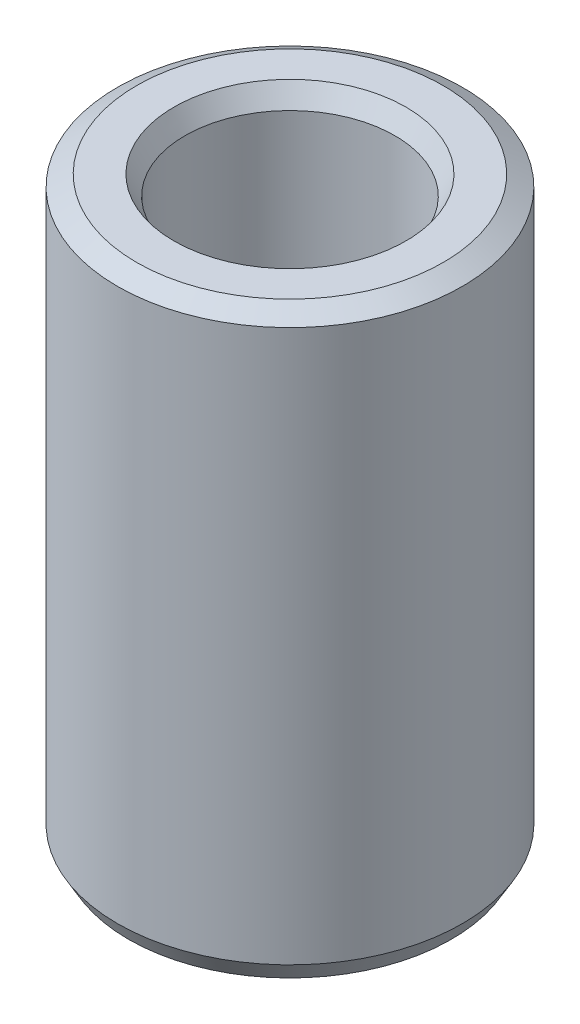
ISO-10303-21;
HEADER;
FILE_DESCRIPTION(('STEP AP214'),'2;1');
FILE_NAME('part.step','',(''),(''),'','','');
FILE_SCHEMA(('AUTOMOTIVE_DESIGN { 1 0 10303 214 1 1 1 1 }'));
ENDSEC;
DATA;
#1=APPLICATION_CONTEXT('core data for automotive mechanical design processes');
#2=APPLICATION_PROTOCOL_DEFINITION('international standard','automotive_design',2000,#1);
#3=PRODUCT_CONTEXT('',#1,'mechanical');
#4=PRODUCT('Part','Part','',(#3));
#5=PRODUCT_RELATED_PRODUCT_CATEGORY('part','',(#4));
#6=PRODUCT_DEFINITION_FORMATION('','',#4);
#7=PRODUCT_DEFINITION_CONTEXT('part definition',#1,'design');
#8=PRODUCT_DEFINITION('design','',#6,#7);
#9=PRODUCT_DEFINITION_SHAPE('','',#8);
#10=(LENGTH_UNIT() NAMED_UNIT(*) SI_UNIT(.MILLI.,.METRE.));
#11=(NAMED_UNIT(*) PLANE_ANGLE_UNIT() SI_UNIT($,.RADIAN.));
#12=(NAMED_UNIT(*) SI_UNIT($,.STERADIAN.) SOLID_ANGLE_UNIT());
#13=UNCERTAINTY_MEASURE_WITH_UNIT(LENGTH_MEASURE(1.E-05),#10,'distance_accuracy_value','');
#14=(GEOMETRIC_REPRESENTATION_CONTEXT(3) GLOBAL_UNCERTAINTY_ASSIGNED_CONTEXT((#13)) GLOBAL_UNIT_ASSIGNED_CONTEXT((#10,
#11,#12)) REPRESENTATION_CONTEXT('',''));
#15=CARTESIAN_POINT('',(0.,0.,0.));
#16=DIRECTION('',(0.,0.,1.));
#17=DIRECTION('',(1.,0.,0.));
#18=AXIS2_PLACEMENT_3D('',#15,#16,#17);
#19=CARTESIAN_POINT('',(0.,143.456491822733,0.));
#20=DIRECTION('',(0.,-1.,0.));
#21=DIRECTION('',(0.,0.,-1.));
#22=AXIS2_PLACEMENT_3D('',#19,#20,#21);
#23=CYLINDRICAL_SURFACE('',#22,42.5);
#24=CARTESIAN_POINT('',(0.,4.73199062983629,0.));
#25=DIRECTION('',(0.,1.,0.));
#26=DIRECTION('',(0.,0.,1.));
#27=AXIS2_PLACEMENT_3D('',#24,#25,#26);
#28=CIRCLE('',#27,42.5);
#29=CARTESIAN_POINT('',(0.,4.73199062983629,42.5));
#30=VERTEX_POINT('',#29);
#31=EDGE_CURVE('E10',#30,#30,#28,.T.);
#32=ORIENTED_EDGE('',*,*,#31,.T.);
#33=EDGE_LOOP('',(#32));
#34=FACE_BOUND('',#33,.T.);
#35=CARTESIAN_POINT('',(0.,140.724475758794,0.));
#36=DIRECTION('',(0.,1.,0.));
#37=DIRECTION('',(0.,0.,1.));
#38=AXIS2_PLACEMENT_3D('',#35,#36,#37);
#39=CIRCLE('',#38,42.5);
#40=CARTESIAN_POINT('',(0.,140.724475758794,42.5));
#41=VERTEX_POINT('',#40);
#42=EDGE_CURVE('E50',#41,#41,#39,.F.);
#43=ORIENTED_EDGE('',*,*,#42,.T.);
#44=EDGE_LOOP('',(#43));
#45=FACE_BOUND('',#44,.T.);
#46=ADVANCED_FACE('F39',(#34,#45),#23,.T.);
#47=CARTESIAN_POINT('',(0.,143.456491822733,0.));
#48=DIRECTION('',(0.,1.,0.));
#49=DIRECTION('',(0.,0.,1.));
#50=AXIS2_PLACEMENT_3D('',#47,#48,#49);
#51=PLANE('',#50);
#52=CARTESIAN_POINT('',(0.,143.456491822733,0.));
#53=DIRECTION('',(0.,1.,0.));
#54=DIRECTION('',(0.,0.,1.));
#55=AXIS2_PLACEMENT_3D('',#52,#53,#54);
#56=CIRCLE('',#55,28.5861831983286);
#57=CARTESIAN_POINT('',(0.,143.456491822733,28.5861831983286));
#58=VERTEX_POINT('',#57);
#59=EDGE_CURVE('E58',#58,#58,#56,.F.);
#60=ORIENTED_EDGE('',*,*,#59,.T.);
#61=EDGE_LOOP('',(#60));
#62=FACE_BOUND('',#61,.T.);
#63=CARTESIAN_POINT('',(0.,143.456491822733,0.));
#64=DIRECTION('',(0.,1.,0.));
#65=DIRECTION('',(0.,0.,1.));
#66=AXIS2_PLACEMENT_3D('',#63,#64,#65);
#67=CIRCLE('',#66,37.7680093701637);
#68=CARTESIAN_POINT('',(0.,143.456491822733,37.7680093701637));
#69=VERTEX_POINT('',#68);
#70=EDGE_CURVE('E61',#69,#69,#67,.T.);
#71=ORIENTED_EDGE('',*,*,#70,.T.);
#72=EDGE_LOOP('',(#71));
#73=FACE_BOUND('',#72,.T.);
#74=ADVANCED_FACE('F88',(#62,#73),#51,.T.);
#75=CARTESIAN_POINT('',(0.,0.,0.));
#76=DIRECTION('',(0.,1.,0.));
#77=DIRECTION('',(0.,0.,1.));
#78=AXIS2_PLACEMENT_3D('',#75,#76,#77);
#79=PLANE('',#78);
#80=CARTESIAN_POINT('',(0.,0.,0.));
#81=DIRECTION('',(0.,1.,0.));
#82=DIRECTION('',(0.,0.,1.));
#83=AXIS2_PLACEMENT_3D('',#80,#81,#82);
#84=CIRCLE('',#83,30.5861577642262);
#85=CARTESIAN_POINT('',(0.,0.,30.5861577642262));
#86=VERTEX_POINT('',#85);
#87=EDGE_CURVE('E51',#86,#86,#84,.T.);
#88=ORIENTED_EDGE('',*,*,#87,.T.);
#89=EDGE_LOOP('',(#88));
#90=FACE_BOUND('',#89,.T.);
#91=CARTESIAN_POINT('',(0.,0.,0.));
#92=DIRECTION('',(0.,1.,0.));
#93=DIRECTION('',(0.,0.,1.));
#94=AXIS2_PLACEMENT_3D('',#91,#92,#93);
#95=CIRCLE('',#94,39.7679839360612);
#96=CARTESIAN_POINT('',(0.,0.,39.7679839360612));
#97=VERTEX_POINT('',#96);
#98=EDGE_CURVE('E54',#97,#97,#95,.F.);
#99=ORIENTED_EDGE('',*,*,#98,.T.);
#100=EDGE_LOOP('',(#99));
#101=FACE_BOUND('',#100,.T.);
#102=ADVANCED_FACE('F83',(#90,#101),#79,.F.);
#103=CARTESIAN_POINT('',(0.,143.456491822733,0.));
#104=DIRECTION('',(0.,-1.,0.));
#105=DIRECTION('',(0.,0.,-1.));
#106=AXIS2_PLACEMENT_3D('',#103,#104,#105);
#107=CYLINDRICAL_SURFACE('',#106,25.8541671343898);
#108=CARTESIAN_POINT('',(0.,138.724501192897,0.));
#109=DIRECTION('',(0.,1.,0.));
#110=DIRECTION('',(0.,0.,1.));
#111=AXIS2_PLACEMENT_3D('',#108,#109,#110);
#112=CIRCLE('',#111,25.8541671343898);
#113=CARTESIAN_POINT('',(0.,138.724501192897,25.8541671343898));
#114=VERTEX_POINT('',#113);
#115=EDGE_CURVE('E67',#114,#114,#112,.T.);
#116=ORIENTED_EDGE('',*,*,#115,.T.);
#117=EDGE_LOOP('',(#116));
#118=FACE_BOUND('',#117,.T.);
#119=CARTESIAN_POINT('',(0.,2.7320160639388,0.));
#120=DIRECTION('',(0.,1.,0.));
#121=DIRECTION('',(0.,0.,1.));
#122=AXIS2_PLACEMENT_3D('',#119,#120,#121);
#123=CIRCLE('',#122,25.8541671343898);
#124=CARTESIAN_POINT('',(0.,2.7320160639388,25.8541671343898));
#125=VERTEX_POINT('',#124);
#126=EDGE_CURVE('E69',#125,#125,#123,.F.);
#127=ORIENTED_EDGE('',*,*,#126,.T.);
#128=EDGE_LOOP('',(#127));
#129=FACE_BOUND('',#128,.T.);
#130=ADVANCED_FACE('F71',(#118,#129),#107,.F.);
#131=CARTESIAN_POINT('',(0.,138.724501192897,0.));
#132=DIRECTION('',(0.,1.,0.));
#133=DIRECTION('',(0.,0.,1.));
#134=AXIS2_PLACEMENT_3D('',#131,#132,#133);
#135=CONICAL_SURFACE('',#134,25.8541671343898,0.523598775598303);
#136=ORIENTED_EDGE('',*,*,#59,.F.);
#137=EDGE_LOOP('',(#136));
#138=FACE_BOUND('',#137,.T.);
#139=ORIENTED_EDGE('',*,*,#115,.F.);
#140=EDGE_LOOP('',(#139));
#141=FACE_BOUND('',#140,.T.);
#142=ADVANCED_FACE('F77',(#138,#141),#135,.F.);
#143=CARTESIAN_POINT('',(0.,0.,0.));
#144=DIRECTION('',(0.,-1.,0.));
#145=DIRECTION('',(0.,0.,-1.));
#146=AXIS2_PLACEMENT_3D('',#143,#144,#145);
#147=CONICAL_SURFACE('',#146,30.5861577642262,1.0471975511966);
#148=ORIENTED_EDGE('',*,*,#126,.F.);
#149=EDGE_LOOP('',(#148));
#150=FACE_BOUND('',#149,.T.);
#151=ORIENTED_EDGE('',*,*,#87,.F.);
#152=EDGE_LOOP('',(#151));
#153=FACE_BOUND('',#152,.T.);
#154=ADVANCED_FACE('F73',(#150,#153),#147,.F.);
#155=CARTESIAN_POINT('',(0.,4.73199062983629,0.));
#156=DIRECTION('',(0.,1.,0.));
#157=DIRECTION('',(0.,0.,1.));
#158=AXIS2_PLACEMENT_3D('',#155,#156,#157);
#159=CONICAL_SURFACE('',#158,42.5,0.523598775598302);
#160=CARTESIAN_POINT('',(0.,0.,39.7679839360612));
#161=CARTESIAN_POINT('',(0.,0.0492915690607938,39.7964424367273));
#162=CARTESIAN_POINT('',(0.,0.0985831381215884,39.8249009373933));
#163=CARTESIAN_POINT('',(0.,0.197166276243178,39.8818179387253));
#164=CARTESIAN_POINT('',(0.,0.246457845303972,39.9102764393914));
#165=CARTESIAN_POINT('',(0.,0.345040983425562,39.9671934407234));
#166=CARTESIAN_POINT('',(0.,0.394332552486356,39.9956519413895));
#167=CARTESIAN_POINT('',(0.,0.492915690607945,40.0525689427215));
#168=CARTESIAN_POINT('',(0.,0.54220725966874,40.0810274433875));
#169=CARTESIAN_POINT('',(0.,0.640790397790329,40.1379444447196));
#170=CARTESIAN_POINT('',(0.,0.690081966851124,40.1664029453856));
#171=CARTESIAN_POINT('',(0.,0.788665104972714,40.2233199467177));
#172=CARTESIAN_POINT('',(0.,0.837956674033508,40.2517784473837));
#173=CARTESIAN_POINT('',(0.,0.936539812155097,40.3086954487158));
#174=CARTESIAN_POINT('',(0.,0.985831381215892,40.3371539493818));
#175=CARTESIAN_POINT('',(0.,1.08441451933748,40.3940709507139));
#176=CARTESIAN_POINT('',(0.,1.13370608839828,40.4225294513799));
#177=CARTESIAN_POINT('',(0.,1.23228922651986,40.4794464527119));
#178=CARTESIAN_POINT('',(0.,1.28158079558066,40.507904953378));
#179=CARTESIAN_POINT('',(0.,1.38016393370225,40.56482195471));
#180=CARTESIAN_POINT('',(0.,1.42945550276304,40.5932804553761));
#181=CARTESIAN_POINT('',(0.,1.52803864088463,40.6501974567081));
#182=CARTESIAN_POINT('',(0.,1.57733020994543,40.6786559573741));
#183=CARTESIAN_POINT('',(0.,1.67591334806702,40.7355729587062));
#184=CARTESIAN_POINT('',(0.,1.72520491712781,40.7640314593722));
#185=CARTESIAN_POINT('',(0.,1.8237880552494,40.8209484607043));
#186=CARTESIAN_POINT('',(0.,1.8730796243102,40.8494069613703));
#187=CARTESIAN_POINT('',(0.,1.97166276243178,40.9063239627024));
#188=CARTESIAN_POINT('',(0.,2.02095433149258,40.9347824633684));
#189=CARTESIAN_POINT('',(0.,2.11953746961417,40.9916994647005));
#190=CARTESIAN_POINT('',(0.,2.16882903867496,41.0201579653665));
#191=CARTESIAN_POINT('',(0.,2.26741217679655,41.0770749666986));
#192=CARTESIAN_POINT('',(0.,2.31670374585735,41.1055334673646));
#193=CARTESIAN_POINT('',(0.,2.41528688397894,41.1624504686966));
#194=CARTESIAN_POINT('',(0.,2.46457845303973,41.1909089693627));
#195=CARTESIAN_POINT('',(0.,2.56316159116132,41.2478259706947));
#196=CARTESIAN_POINT('',(0.,2.61245316022212,41.2762844713608));
#197=CARTESIAN_POINT('',(0.,2.7110362983437,41.3332014726928));
#198=CARTESIAN_POINT('',(0.,2.7603278674045,41.3616599733588));
#199=CARTESIAN_POINT('',(0.,2.85891100552609,41.4185769746909));
#200=CARTESIAN_POINT('',(0.,2.90820257458688,41.4470354753569));
#201=CARTESIAN_POINT('',(0.,3.00678571270847,41.503952476689));
#202=CARTESIAN_POINT('',(0.,3.05607728176927,41.532410977355));
#203=CARTESIAN_POINT('',(0.,3.15466041989086,41.5893279786871));
#204=CARTESIAN_POINT('',(0.,3.20395198895165,41.6177864793531));
#205=CARTESIAN_POINT('',(0.,3.30253512707324,41.6747034806852));
#206=CARTESIAN_POINT('',(0.,3.35182669613403,41.7031619813512));
#207=CARTESIAN_POINT('',(0.,3.45040983425562,41.7600789826833));
#208=CARTESIAN_POINT('',(0.,3.49970140331642,41.7885374833493));
#209=CARTESIAN_POINT('',(0.,3.59828454143801,41.8454544846813));
#210=CARTESIAN_POINT('',(0.,3.6475761104988,41.8739129853474));
#211=CARTESIAN_POINT('',(0.,3.74615924862039,41.9308299866794));
#212=CARTESIAN_POINT('',(0.,3.79545081768119,41.9592884873455));
#213=CARTESIAN_POINT('',(0.,3.89403395580278,42.0162054886775));
#214=CARTESIAN_POINT('',(0.,3.94332552486357,42.0446639893435));
#215=CARTESIAN_POINT('',(0.,4.04190866298516,42.1015809906756));
#216=CARTESIAN_POINT('',(0.,4.09120023204595,42.1300394913416));
#217=CARTESIAN_POINT('',(0.,4.18978337016754,42.1869564926737));
#218=CARTESIAN_POINT('',(0.,4.23907493922834,42.2154149933397));
#219=CARTESIAN_POINT('',(0.,4.33765807734993,42.2723319946718));
#220=CARTESIAN_POINT('',(0.,4.38694964641072,42.3007904953378));
#221=CARTESIAN_POINT('',(0.,4.48553278453231,42.3577074966699));
#222=CARTESIAN_POINT('',(0.,4.53482435359311,42.3861659973359));
#223=CARTESIAN_POINT('',(0.,4.6334074917147,42.443082998668));
#224=CARTESIAN_POINT('',(0.,4.68269906077549,42.471541499334));
#225=CARTESIAN_POINT('',(0.,4.73199062983629,42.5));
#226=B_SPLINE_CURVE_WITH_KNOTS('',3,(#160,#161,#162,#163,#164,#165,#166,#167,#168,#169,#170,
#171,#172,#173,#174,#175,#176,#177,#178,#179,#180,#181,#182,#183,#184,#185,#186,#187,#188,#189,
#190,#191,#192,#193,#194,#195,#196,#197,#198,#199,#200,#201,#202,#203,#204,#205,#206,#207,#208,
#209,#210,#211,#212,#213,#214,#215,#216,#217,#218,#219,#220,#221,#222,#223,#224,#225),
.UNSPECIFIED.,.F.,.F.,(4,2,2,2,2,2,2,2,2,2,2,2,2,2,2,2,2,2,2,2,2,2,2,2,2,2,2,2,2,2,2,2,4),(0.,
0.170751003996173,0.341502007992347,0.51225301198852,0.683004015984694,0.853755019980864,
1.02450602397704,1.19525702797321,1.36600803196938,1.53675903596556,1.70751003996173,
1.8782610439579,2.04901204795408,2.21976305195025,2.39051405594642,2.5612650599426,
2.73201606393877,2.90276706793494,3.07351807193112,3.24426907592729,3.41502007992346,
3.58577108391964,3.75652208791581,3.92727309191198,4.09802409590815,4.26877509990433,
4.4395261039005,4.61027710789668,4.78102811189285,4.95177911588902,5.1225301198852,
5.29328112388137,5.46403212787754),.UNSPECIFIED.);
#227=EDGE_CURVE('BSEAM76',#97,#30,#226,.T.);
#228=ORIENTED_EDGE('',*,*,#98,.F.);
#229=ORIENTED_EDGE('',*,*,#31,.F.);
#230=ORIENTED_EDGE('',*,*,#227,.T.);
#231=ORIENTED_EDGE('',*,*,#227,.F.);
#232=EDGE_LOOP('',(#228,#230,#229,#231));
#233=FACE_BOUND('',#232,.T.);
#234=ADVANCED_FACE('F76',(#233),#159,.T.);
#235=CARTESIAN_POINT('',(0.,143.456491822733,0.));
#236=DIRECTION('',(0.,-1.,0.));
#237=DIRECTION('',(0.,0.,-1.));
#238=AXIS2_PLACEMENT_3D('',#235,#236,#237);
#239=CONICAL_SURFACE('',#238,37.7680093701637,1.0471975511966);
#240=ORIENTED_EDGE('',*,*,#42,.F.);
#241=EDGE_LOOP('',(#240));
#242=FACE_BOUND('',#241,.T.);
#243=ORIENTED_EDGE('',*,*,#70,.F.);
#244=EDGE_LOOP('',(#243));
#245=FACE_BOUND('',#244,.T.);
#246=ADVANCED_FACE('F45',(#242,#245),#239,.T.);
#247=CLOSED_SHELL('',(#46,#74,#102,#130,#142,#154,#234,#246));
#248=MANIFOLD_SOLID_BREP('B2',#247);
#249=ADVANCED_BREP_SHAPE_REPRESENTATION('',(#18,#248),#14);
#250=SHAPE_DEFINITION_REPRESENTATION(#9,#249);
ENDSEC;
END-ISO-10303-21;
